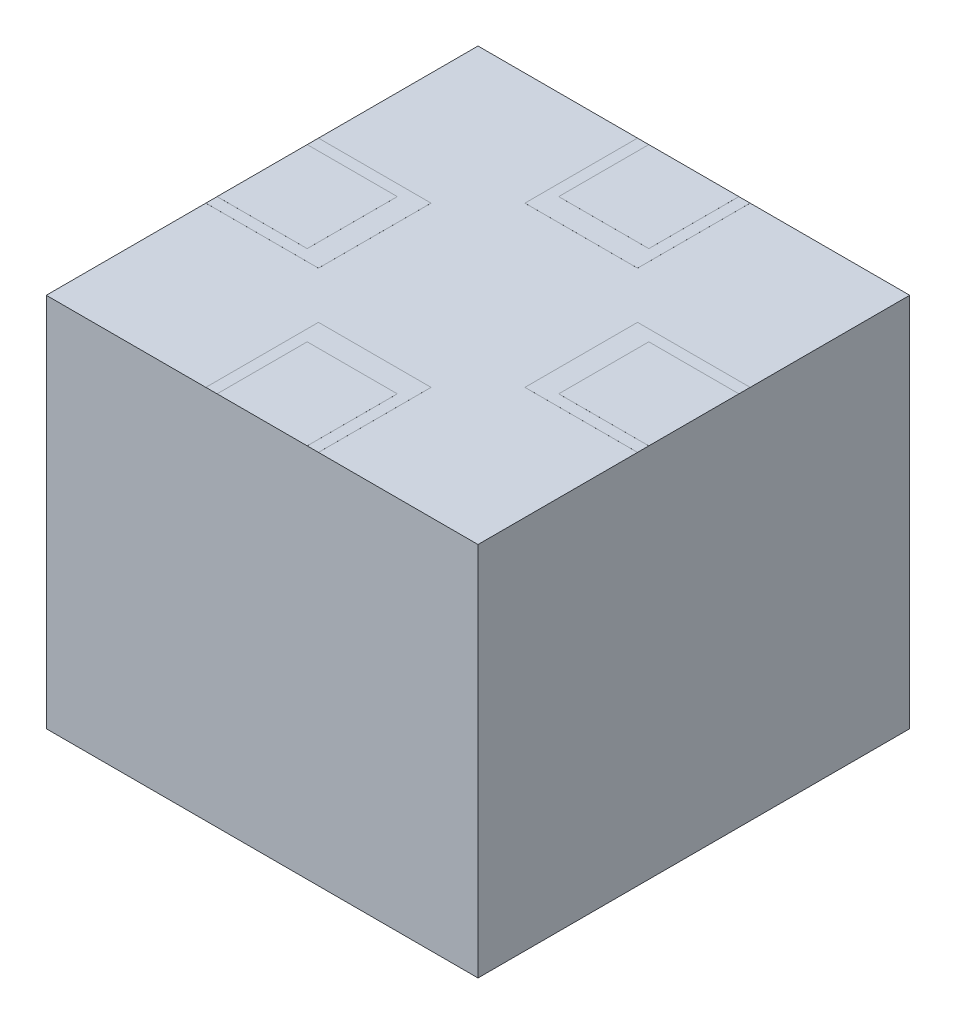
ISO-10303-21;
HEADER;
FILE_DESCRIPTION(('STEP AP214'),'2;1');
FILE_NAME('part.step','',(''),(''),'','','');
FILE_SCHEMA(('AUTOMOTIVE_DESIGN { 1 0 10303 214 1 1 1 1 }'));
ENDSEC;
DATA;
#1=APPLICATION_CONTEXT('core data for automotive mechanical design processes');
#2=APPLICATION_PROTOCOL_DEFINITION('international standard','automotive_design',2000,#1);
#3=PRODUCT_CONTEXT('',#1,'mechanical');
#4=PRODUCT('Part','Part','',(#3));
#5=PRODUCT_RELATED_PRODUCT_CATEGORY('part','',(#4));
#6=PRODUCT_DEFINITION_FORMATION('','',#4);
#7=PRODUCT_DEFINITION_CONTEXT('part definition',#1,'design');
#8=PRODUCT_DEFINITION('design','',#6,#7);
#9=PRODUCT_DEFINITION_SHAPE('','',#8);
#10=(LENGTH_UNIT() NAMED_UNIT(*) SI_UNIT(.MILLI.,.METRE.));
#11=(NAMED_UNIT(*) PLANE_ANGLE_UNIT() SI_UNIT($,.RADIAN.));
#12=(NAMED_UNIT(*) SI_UNIT($,.STERADIAN.) SOLID_ANGLE_UNIT());
#13=UNCERTAINTY_MEASURE_WITH_UNIT(LENGTH_MEASURE(1.E-05),#10,'distance_accuracy_value','');
#14=(GEOMETRIC_REPRESENTATION_CONTEXT(3) GLOBAL_UNCERTAINTY_ASSIGNED_CONTEXT((#13)) GLOBAL_UNIT_ASSIGNED_CONTEXT((#10,
#11,#12)) REPRESENTATION_CONTEXT('',''));
#15=CARTESIAN_POINT('',(0.,0.,0.));
#16=DIRECTION('',(0.,0.,1.));
#17=DIRECTION('',(1.,0.,0.));
#18=AXIS2_PLACEMENT_3D('',#15,#16,#17);
#19=CARTESIAN_POINT('',(0.,200.,0.));
#20=DIRECTION('',(0.,-1.,0.));
#21=DIRECTION('',(0.,0.,-1.));
#22=AXIS2_PLACEMENT_3D('',#19,#20,#21);
#23=PLANE('',#22);
#24=DIRECTION('',(-1.,0.,0.));
#25=VECTOR('',#24,1.);
#26=CARTESIAN_POINT('',(-115.,200.,-30.));
#27=LINE('',#26,#25);
#28=CARTESIAN_POINT('',(-55.,200.,-30.));
#29=VERTEX_POINT('',#28);
#30=CARTESIAN_POINT('',(-115.,200.,-30.));
#31=VERTEX_POINT('',#30);
#32=EDGE_CURVE('E383',#29,#31,#27,.T.);
#33=ORIENTED_EDGE('',*,*,#32,.F.);
#34=DIRECTION('',(0.,0.,-1.));
#35=VECTOR('',#34,1.);
#36=CARTESIAN_POINT('',(-55.,200.,29.9999999999999));
#37=LINE('',#36,#35);
#38=CARTESIAN_POINT('',(-55.,200.,29.9999999999999));
#39=VERTEX_POINT('',#38);
#40=EDGE_CURVE('E387',#39,#29,#37,.T.);
#41=ORIENTED_EDGE('',*,*,#40,.F.);
#42=DIRECTION('',(1.,0.,0.));
#43=VECTOR('',#42,1.);
#44=CARTESIAN_POINT('',(-115.,200.,30.));
#45=LINE('',#44,#43);
#46=CARTESIAN_POINT('',(-115.,200.,30.));
#47=VERTEX_POINT('',#46);
#48=EDGE_CURVE('E397',#47,#39,#45,.T.);
#49=ORIENTED_EDGE('',*,*,#48,.F.);
#50=DIRECTION('',(0.,0.,1.));
#51=VECTOR('',#50,1.);
#52=CARTESIAN_POINT('',(-115.,200.,115.));
#53=LINE('',#52,#51);
#54=CARTESIAN_POINT('',(-115.,200.,115.));
#55=VERTEX_POINT('',#54);
#56=EDGE_CURVE('E513',#47,#55,#53,.T.);
#57=ORIENTED_EDGE('',*,*,#56,.T.);
#58=DIRECTION('',(1.,0.,0.));
#59=VECTOR('',#58,1.);
#60=CARTESIAN_POINT('',(-115.,200.,115.));
#61=LINE('',#60,#59);
#62=CARTESIAN_POINT('',(-30.,200.,115.));
#63=VERTEX_POINT('',#62);
#64=EDGE_CURVE('E517',#55,#63,#61,.T.);
#65=ORIENTED_EDGE('',*,*,#64,.T.);
#66=DIRECTION('',(0.,0.,1.));
#67=VECTOR('',#66,1.);
#68=CARTESIAN_POINT('',(-30.,200.,115.));
#69=LINE('',#68,#67);
#70=CARTESIAN_POINT('',(-30.,200.,55.));
#71=VERTEX_POINT('',#70);
#72=EDGE_CURVE('E413',#71,#63,#69,.T.);
#73=ORIENTED_EDGE('',*,*,#72,.F.);
#74=DIRECTION('',(-1.,0.,0.));
#75=VECTOR('',#74,1.);
#76=CARTESIAN_POINT('',(29.9999999999999,200.,55.));
#77=LINE('',#76,#75);
#78=CARTESIAN_POINT('',(29.9999999999999,200.,55.));
#79=VERTEX_POINT('',#78);
#80=EDGE_CURVE('E418',#79,#71,#77,.T.);
#81=ORIENTED_EDGE('',*,*,#80,.F.);
#82=DIRECTION('',(0.,0.,-1.));
#83=VECTOR('',#82,1.);
#84=CARTESIAN_POINT('',(29.9999999999999,200.,115.));
#85=LINE('',#84,#83);
#86=CARTESIAN_POINT('',(29.9999999999999,200.,115.));
#87=VERTEX_POINT('',#86);
#88=EDGE_CURVE('E428',#87,#79,#85,.T.);
#89=ORIENTED_EDGE('',*,*,#88,.F.);
#90=CARTESIAN_POINT('',(115.,200.,115.));
#91=VERTEX_POINT('',#90);
#92=EDGE_CURVE('E516',#87,#91,#61,.T.);
#93=ORIENTED_EDGE('',*,*,#92,.T.);
#94=DIRECTION('',(0.,0.,-1.));
#95=VECTOR('',#94,1.);
#96=CARTESIAN_POINT('',(115.,200.,115.));
#97=LINE('',#96,#95);
#98=CARTESIAN_POINT('',(115.,200.,30.));
#99=VERTEX_POINT('',#98);
#100=EDGE_CURVE('E507',#91,#99,#97,.T.);
#101=ORIENTED_EDGE('',*,*,#100,.T.);
#102=DIRECTION('',(1.,0.,0.));
#103=VECTOR('',#102,1.);
#104=CARTESIAN_POINT('',(115.,200.,30.));
#105=LINE('',#104,#103);
#106=CARTESIAN_POINT('',(55.,200.,30.));
#107=VERTEX_POINT('',#106);
#108=EDGE_CURVE('E444',#107,#99,#105,.T.);
#109=ORIENTED_EDGE('',*,*,#108,.F.);
#110=DIRECTION('',(0.,0.,1.));
#111=VECTOR('',#110,1.);
#112=CARTESIAN_POINT('',(55.,200.,-29.9999999999999));
#113=LINE('',#112,#111);
#114=CARTESIAN_POINT('',(55.,200.,-29.9999999999999));
#115=VERTEX_POINT('',#114);
#116=EDGE_CURVE('E449',#115,#107,#113,.T.);
#117=ORIENTED_EDGE('',*,*,#116,.F.);
#118=DIRECTION('',(-1.,0.,0.));
#119=VECTOR('',#118,1.);
#120=CARTESIAN_POINT('',(115.,200.,-30.));
#121=LINE('',#120,#119);
#122=CARTESIAN_POINT('',(115.,200.,-30.));
#123=VERTEX_POINT('',#122);
#124=EDGE_CURVE('E459',#123,#115,#121,.T.);
#125=ORIENTED_EDGE('',*,*,#124,.F.);
#126=CARTESIAN_POINT('',(115.,200.,-115.));
#127=VERTEX_POINT('',#126);
#128=EDGE_CURVE('E510',#123,#127,#97,.T.);
#129=ORIENTED_EDGE('',*,*,#128,.T.);
#130=DIRECTION('',(-1.,0.,0.));
#131=VECTOR('',#130,1.);
#132=CARTESIAN_POINT('',(-115.,200.,-115.));
#133=LINE('',#132,#131);
#134=CARTESIAN_POINT('',(30.,200.,-115.));
#135=VERTEX_POINT('',#134);
#136=EDGE_CURVE('E511',#127,#135,#133,.T.);
#137=ORIENTED_EDGE('',*,*,#136,.T.);
#138=DIRECTION('',(0.,0.,-1.));
#139=VECTOR('',#138,1.);
#140=CARTESIAN_POINT('',(30.,200.,-115.));
#141=LINE('',#140,#139);
#142=CARTESIAN_POINT('',(30.,200.,-55.));
#143=VERTEX_POINT('',#142);
#144=EDGE_CURVE('E475',#143,#135,#141,.T.);
#145=ORIENTED_EDGE('',*,*,#144,.F.);
#146=DIRECTION('',(1.,0.,0.));
#147=VECTOR('',#146,1.);
#148=CARTESIAN_POINT('',(-30.,200.,-55.));
#149=LINE('',#148,#147);
#150=CARTESIAN_POINT('',(-30.,200.,-55.));
#151=VERTEX_POINT('',#150);
#152=EDGE_CURVE('E480',#151,#143,#149,.T.);
#153=ORIENTED_EDGE('',*,*,#152,.F.);
#154=DIRECTION('',(0.,0.,1.));
#155=VECTOR('',#154,1.);
#156=CARTESIAN_POINT('',(-30.,200.,-115.));
#157=LINE('',#156,#155);
#158=CARTESIAN_POINT('',(-30.,200.,-115.));
#159=VERTEX_POINT('',#158);
#160=EDGE_CURVE('E490',#159,#151,#157,.T.);
#161=ORIENTED_EDGE('',*,*,#160,.F.);
#162=CARTESIAN_POINT('',(-115.,200.,-115.));
#163=VERTEX_POINT('',#162);
#164=EDGE_CURVE('E509',#159,#163,#133,.T.);
#165=ORIENTED_EDGE('',*,*,#164,.T.);
#166=EDGE_CURVE('E514',#163,#31,#53,.T.);
#167=ORIENTED_EDGE('',*,*,#166,.T.);
#168=EDGE_LOOP('',(#33,#41,#49,#57,#65,#73,#81,#89,#93,#101,#109,#117,#125,#129,#137,#145,#153,
#161,#165,#167));
#169=FACE_BOUND('',#168,.T.);
#170=ADVANCED_FACE('F33',(#169),#23,.F.);
#171=CARTESIAN_POINT('',(115.,200.,115.));
#172=DIRECTION('',(-1.,0.,0.));
#173=DIRECTION('',(0.,0.,1.));
#174=AXIS2_PLACEMENT_3D('',#171,#172,#173);
#175=PLANE('',#174);
#176=DIRECTION('',(0.,0.,-1.));
#177=VECTOR('',#176,1.);
#178=CARTESIAN_POINT('',(115.,0.,115.));
#179=LINE('',#178,#177);
#180=CARTESIAN_POINT('',(115.,0.,115.));
#181=VERTEX_POINT('',#180);
#182=CARTESIAN_POINT('',(115.,0.,-115.));
#183=VERTEX_POINT('',#182);
#184=EDGE_CURVE('E506',#181,#183,#179,.T.);
#185=ORIENTED_EDGE('',*,*,#184,.T.);
#186=DIRECTION('',(0.,-1.,0.));
#187=VECTOR('',#186,1.);
#188=CARTESIAN_POINT('',(115.,200.,-115.));
#189=LINE('',#188,#187);
#190=EDGE_CURVE('E11',#127,#183,#189,.T.);
#191=ORIENTED_EDGE('',*,*,#190,.F.);
#192=ORIENTED_EDGE('',*,*,#128,.F.);
#193=DIRECTION('',(0.,-1.,0.));
#194=VECTOR('',#193,1.);
#195=CARTESIAN_POINT('',(115.,200.01,-30.));
#196=LINE('',#195,#194);
#197=CARTESIAN_POINT('',(115.,200.01,-30.));
#198=VERTEX_POINT('',#197);
#199=EDGE_CURVE('E469',#198,#123,#196,.T.);
#200=ORIENTED_EDGE('',*,*,#199,.F.);
#201=DIRECTION('',(0.,0.,-1.));
#202=VECTOR('',#201,1.);
#203=CARTESIAN_POINT('',(115.,200.01,-30.));
#204=LINE('',#203,#202);
#205=CARTESIAN_POINT('',(115.,200.01,-24.0000000000104));
#206=VERTEX_POINT('',#205);
#207=EDGE_CURVE('E448',#206,#198,#204,.T.);
#208=ORIENTED_EDGE('',*,*,#207,.F.);
#209=DIRECTION('',(0.,-1.,0.));
#210=VECTOR('',#209,1.);
#211=CARTESIAN_POINT('',(115.000000000005,200.02,-24.0000000000104));
#212=LINE('',#211,#210);
#213=CARTESIAN_POINT('',(115.000000000005,200.02,-24.0000000000104));
#214=VERTEX_POINT('',#213);
#215=EDGE_CURVE('E350',#214,#206,#212,.T.);
#216=ORIENTED_EDGE('',*,*,#215,.F.);
#217=DIRECTION('',(0.,0.,-1.));
#218=VECTOR('',#217,1.);
#219=CARTESIAN_POINT('',(115.000000000005,200.02,-24.0000000000104));
#220=LINE('',#219,#218);
#221=CARTESIAN_POINT('',(115.000000000005,200.02,23.9999999999896));
#222=VERTEX_POINT('',#221);
#223=EDGE_CURVE('E324',#222,#214,#220,.T.);
#224=ORIENTED_EDGE('',*,*,#223,.F.);
#225=DIRECTION('',(0.,-1.,0.));
#226=VECTOR('',#225,1.);
#227=CARTESIAN_POINT('',(115.000000000005,200.02,23.9999999999896));
#228=LINE('',#227,#226);
#229=CARTESIAN_POINT('',(115.,200.01,23.9999999999896));
#230=VERTEX_POINT('',#229);
#231=EDGE_CURVE('E334',#222,#230,#228,.T.);
#232=ORIENTED_EDGE('',*,*,#231,.T.);
#233=CARTESIAN_POINT('',(115.,200.01,30.));
#234=VERTEX_POINT('',#233);
#235=EDGE_CURVE('E450',#234,#230,#204,.T.);
#236=ORIENTED_EDGE('',*,*,#235,.F.);
#237=DIRECTION('',(0.,-1.,0.));
#238=VECTOR('',#237,1.);
#239=CARTESIAN_POINT('',(115.,200.01,30.));
#240=LINE('',#239,#238);
#241=EDGE_CURVE('E472',#234,#99,#240,.T.);
#242=ORIENTED_EDGE('',*,*,#241,.T.);
#243=ORIENTED_EDGE('',*,*,#100,.F.);
#244=DIRECTION('',(0.,-1.,0.));
#245=VECTOR('',#244,1.);
#246=CARTESIAN_POINT('',(115.,200.,115.));
#247=LINE('',#246,#245);
#248=EDGE_CURVE('E519',#91,#181,#247,.T.);
#249=ORIENTED_EDGE('',*,*,#248,.T.);
#250=EDGE_LOOP('',(#185,#191,#192,#200,#208,#216,#224,#232,#236,#242,#243,#249));
#251=FACE_BOUND('',#250,.T.);
#252=ADVANCED_FACE('F35',(#251),#175,.F.);
#253=CARTESIAN_POINT('',(-115.,200.,-115.));
#254=DIRECTION('',(0.,0.,1.));
#255=DIRECTION('',(1.,0.,0.));
#256=AXIS2_PLACEMENT_3D('',#253,#254,#255);
#257=PLANE('',#256);
#258=DIRECTION('',(-1.,0.,0.));
#259=VECTOR('',#258,1.);
#260=CARTESIAN_POINT('',(-115.,0.,-115.));
#261=LINE('',#260,#259);
#262=CARTESIAN_POINT('',(-115.,0.,-115.));
#263=VERTEX_POINT('',#262);
#264=EDGE_CURVE('E522',#183,#263,#261,.T.);
#265=ORIENTED_EDGE('',*,*,#264,.T.);
#266=DIRECTION('',(0.,-1.,0.));
#267=VECTOR('',#266,1.);
#268=CARTESIAN_POINT('',(-115.,200.,-115.));
#269=LINE('',#268,#267);
#270=EDGE_CURVE('E41',#163,#263,#269,.T.);
#271=ORIENTED_EDGE('',*,*,#270,.F.);
#272=ORIENTED_EDGE('',*,*,#164,.F.);
#273=DIRECTION('',(0.,-1.,0.));
#274=VECTOR('',#273,1.);
#275=CARTESIAN_POINT('',(-30.,200.01,-115.));
#276=LINE('',#275,#274);
#277=CARTESIAN_POINT('',(-30.,200.01,-115.));
#278=VERTEX_POINT('',#277);
#279=EDGE_CURVE('E500',#278,#159,#276,.T.);
#280=ORIENTED_EDGE('',*,*,#279,.F.);
#281=DIRECTION('',(-1.,0.,0.));
#282=VECTOR('',#281,1.);
#283=CARTESIAN_POINT('',(-30.,200.01,-115.));
#284=LINE('',#283,#282);
#285=CARTESIAN_POINT('',(-24.,200.01,-115.));
#286=VERTEX_POINT('',#285);
#287=EDGE_CURVE('E479',#286,#278,#284,.T.);
#288=ORIENTED_EDGE('',*,*,#287,.F.);
#289=DIRECTION('',(0.,-1.,0.));
#290=VECTOR('',#289,1.);
#291=CARTESIAN_POINT('',(-24.,200.02,-115.));
#292=LINE('',#291,#290);
#293=CARTESIAN_POINT('',(-24.,200.02,-115.));
#294=VERTEX_POINT('',#293);
#295=EDGE_CURVE('E380',#294,#286,#292,.T.);
#296=ORIENTED_EDGE('',*,*,#295,.F.);
#297=DIRECTION('',(-1.,0.,0.));
#298=VECTOR('',#297,1.);
#299=CARTESIAN_POINT('',(-24.,200.02,-115.));
#300=LINE('',#299,#298);
#301=CARTESIAN_POINT('',(24.,200.02,-115.));
#302=VERTEX_POINT('',#301);
#303=EDGE_CURVE('E354',#302,#294,#300,.T.);
#304=ORIENTED_EDGE('',*,*,#303,.F.);
#305=DIRECTION('',(0.,-1.,0.));
#306=VECTOR('',#305,1.);
#307=CARTESIAN_POINT('',(24.,200.02,-115.));
#308=LINE('',#307,#306);
#309=CARTESIAN_POINT('',(24.,200.01,-115.));
#310=VERTEX_POINT('',#309);
#311=EDGE_CURVE('E364',#302,#310,#308,.T.);
#312=ORIENTED_EDGE('',*,*,#311,.T.);
#313=CARTESIAN_POINT('',(30.,200.01,-115.));
#314=VERTEX_POINT('',#313);
#315=EDGE_CURVE('E481',#314,#310,#284,.T.);
#316=ORIENTED_EDGE('',*,*,#315,.F.);
#317=DIRECTION('',(0.,-1.,0.));
#318=VECTOR('',#317,1.);
#319=CARTESIAN_POINT('',(30.,200.01,-115.));
#320=LINE('',#319,#318);
#321=EDGE_CURVE('E503',#314,#135,#320,.T.);
#322=ORIENTED_EDGE('',*,*,#321,.T.);
#323=ORIENTED_EDGE('',*,*,#136,.F.);
#324=ORIENTED_EDGE('',*,*,#190,.T.);
#325=EDGE_LOOP('',(#265,#271,#272,#280,#288,#296,#304,#312,#316,#322,#323,#324));
#326=FACE_BOUND('',#325,.T.);
#327=ADVANCED_FACE('F625',(#326),#257,.F.);
#328=CARTESIAN_POINT('',(-115.,200.,115.));
#329=DIRECTION('',(1.,0.,0.));
#330=DIRECTION('',(0.,0.,-1.));
#331=AXIS2_PLACEMENT_3D('',#328,#329,#330);
#332=PLANE('',#331);
#333=DIRECTION('',(0.,0.,1.));
#334=VECTOR('',#333,1.);
#335=CARTESIAN_POINT('',(-115.,0.,115.));
#336=LINE('',#335,#334);
#337=CARTESIAN_POINT('',(-115.,0.,115.));
#338=VERTEX_POINT('',#337);
#339=EDGE_CURVE('E524',#263,#338,#336,.T.);
#340=ORIENTED_EDGE('',*,*,#339,.T.);
#341=DIRECTION('',(0.,-1.,0.));
#342=VECTOR('',#341,1.);
#343=CARTESIAN_POINT('',(-115.,200.,115.));
#344=LINE('',#343,#342);
#345=EDGE_CURVE('E530',#55,#338,#344,.T.);
#346=ORIENTED_EDGE('',*,*,#345,.F.);
#347=ORIENTED_EDGE('',*,*,#56,.F.);
#348=DIRECTION('',(0.,-1.,0.));
#349=VECTOR('',#348,1.);
#350=CARTESIAN_POINT('',(-115.,200.01,30.));
#351=LINE('',#350,#349);
#352=CARTESIAN_POINT('',(-115.,200.01,30.));
#353=VERTEX_POINT('',#352);
#354=EDGE_CURVE('E407',#353,#47,#351,.T.);
#355=ORIENTED_EDGE('',*,*,#354,.F.);
#356=DIRECTION('',(0.,0.,1.));
#357=VECTOR('',#356,1.);
#358=CARTESIAN_POINT('',(-115.,200.01,30.));
#359=LINE('',#358,#357);
#360=CARTESIAN_POINT('',(-115.,200.01,24.0000000000049));
#361=VERTEX_POINT('',#360);
#362=EDGE_CURVE('E287',#361,#353,#359,.T.);
#363=ORIENTED_EDGE('',*,*,#362,.F.);
#364=DIRECTION('',(0.,-1.,0.));
#365=VECTOR('',#364,1.);
#366=CARTESIAN_POINT('',(-114.99999999999,200.02,24.0000000000049));
#367=LINE('',#366,#365);
#368=CARTESIAN_POINT('',(-114.99999999999,200.02,24.0000000000049));
#369=VERTEX_POINT('',#368);
#370=EDGE_CURVE('E269',#369,#361,#367,.T.);
#371=ORIENTED_EDGE('',*,*,#370,.F.);
#372=DIRECTION('',(0.,0.,1.));
#373=VECTOR('',#372,1.);
#374=CARTESIAN_POINT('',(-114.99999999999,200.02,24.0000000000049));
#375=LINE('',#374,#373);
#376=CARTESIAN_POINT('',(-114.99999999999,200.02,-23.9999999999951));
#377=VERTEX_POINT('',#376);
#378=EDGE_CURVE('E275',#377,#369,#375,.T.);
#379=ORIENTED_EDGE('',*,*,#378,.F.);
#380=DIRECTION('',(0.,-1.,0.));
#381=VECTOR('',#380,1.);
#382=CARTESIAN_POINT('',(-114.99999999999,200.02,-23.9999999999951));
#383=LINE('',#382,#381);
#384=CARTESIAN_POINT('',(-115.,200.01,-23.9999999999951));
#385=VERTEX_POINT('',#384);
#386=EDGE_CURVE('E596',#377,#385,#383,.T.);
#387=ORIENTED_EDGE('',*,*,#386,.T.);
#388=CARTESIAN_POINT('',(-115.,200.01,-30.));
#389=VERTEX_POINT('',#388);
#390=EDGE_CURVE('E388',#389,#385,#359,.T.);
#391=ORIENTED_EDGE('',*,*,#390,.F.);
#392=DIRECTION('',(0.,-1.,0.));
#393=VECTOR('',#392,1.);
#394=CARTESIAN_POINT('',(-115.,200.01,-30.));
#395=LINE('',#394,#393);
#396=EDGE_CURVE('E410',#389,#31,#395,.T.);
#397=ORIENTED_EDGE('',*,*,#396,.T.);
#398=ORIENTED_EDGE('',*,*,#166,.F.);
#399=ORIENTED_EDGE('',*,*,#270,.T.);
#400=EDGE_LOOP('',(#340,#346,#347,#355,#363,#371,#379,#387,#391,#397,#398,#399));
#401=FACE_BOUND('',#400,.T.);
#402=ADVANCED_FACE('F285',(#401),#332,.F.);
#403=CARTESIAN_POINT('',(-115.,200.,115.));
#404=DIRECTION('',(0.,0.,-1.));
#405=DIRECTION('',(-1.,0.,0.));
#406=AXIS2_PLACEMENT_3D('',#403,#404,#405);
#407=PLANE('',#406);
#408=DIRECTION('',(1.,0.,0.));
#409=VECTOR('',#408,1.);
#410=CARTESIAN_POINT('',(-115.,0.,115.));
#411=LINE('',#410,#409);
#412=EDGE_CURVE('E526',#338,#181,#411,.T.);
#413=ORIENTED_EDGE('',*,*,#412,.T.);
#414=ORIENTED_EDGE('',*,*,#248,.F.);
#415=ORIENTED_EDGE('',*,*,#92,.F.);
#416=DIRECTION('',(0.,-1.,0.));
#417=VECTOR('',#416,1.);
#418=CARTESIAN_POINT('',(29.9999999999999,200.01,115.));
#419=LINE('',#418,#417);
#420=CARTESIAN_POINT('',(29.9999999999999,200.01,115.));
#421=VERTEX_POINT('',#420);
#422=EDGE_CURVE('E438',#421,#87,#419,.T.);
#423=ORIENTED_EDGE('',*,*,#422,.F.);
#424=DIRECTION('',(1.,0.,0.));
#425=VECTOR('',#424,1.);
#426=CARTESIAN_POINT('',(29.9999999999999,200.01,115.));
#427=LINE('',#426,#425);
#428=CARTESIAN_POINT('',(24.0000000000152,200.01,115.));
#429=VERTEX_POINT('',#428);
#430=EDGE_CURVE('E417',#429,#421,#427,.T.);
#431=ORIENTED_EDGE('',*,*,#430,.F.);
#432=DIRECTION('',(0.,-1.,0.));
#433=VECTOR('',#432,1.);
#434=CARTESIAN_POINT('',(24.0000000000153,200.02,114.999999999995));
#435=LINE('',#434,#433);
#436=CARTESIAN_POINT('',(24.0000000000153,200.02,114.999999999995));
#437=VERTEX_POINT('',#436);
#438=EDGE_CURVE('E320',#437,#429,#435,.T.);
#439=ORIENTED_EDGE('',*,*,#438,.F.);
#440=DIRECTION('',(1.,0.,0.));
#441=VECTOR('',#440,1.);
#442=CARTESIAN_POINT('',(24.0000000000153,200.02,114.999999999995));
#443=LINE('',#442,#441);
#444=CARTESIAN_POINT('',(-23.9999999999847,200.02,114.999999999995));
#445=VERTEX_POINT('',#444);
#446=EDGE_CURVE('E297',#445,#437,#443,.T.);
#447=ORIENTED_EDGE('',*,*,#446,.F.);
#448=DIRECTION('',(0.,-1.,0.));
#449=VECTOR('',#448,1.);
#450=CARTESIAN_POINT('',(-23.9999999999847,200.02,114.999999999995));
#451=LINE('',#450,#449);
#452=CARTESIAN_POINT('',(-23.9999999999847,200.01,115.));
#453=VERTEX_POINT('',#452);
#454=EDGE_CURVE('E306',#445,#453,#451,.T.);
#455=ORIENTED_EDGE('',*,*,#454,.T.);
#456=CARTESIAN_POINT('',(-30.,200.01,115.));
#457=VERTEX_POINT('',#456);
#458=EDGE_CURVE('E419',#457,#453,#427,.T.);
#459=ORIENTED_EDGE('',*,*,#458,.F.);
#460=DIRECTION('',(0.,-1.,0.));
#461=VECTOR('',#460,1.);
#462=CARTESIAN_POINT('',(-30.,200.01,115.));
#463=LINE('',#462,#461);
#464=EDGE_CURVE('E441',#457,#63,#463,.T.);
#465=ORIENTED_EDGE('',*,*,#464,.T.);
#466=ORIENTED_EDGE('',*,*,#64,.F.);
#467=ORIENTED_EDGE('',*,*,#345,.T.);
#468=EDGE_LOOP('',(#413,#414,#415,#423,#431,#439,#447,#455,#459,#465,#466,#467));
#469=FACE_BOUND('',#468,.T.);
#470=ADVANCED_FACE('F545',(#469),#407,.F.);
#471=CARTESIAN_POINT('',(0.,0.,0.));
#472=DIRECTION('',(0.,-1.,0.));
#473=DIRECTION('',(0.,0.,-1.));
#474=AXIS2_PLACEMENT_3D('',#471,#472,#473);
#475=PLANE('',#474);
#476=ORIENTED_EDGE('',*,*,#184,.F.);
#477=ORIENTED_EDGE('',*,*,#412,.F.);
#478=ORIENTED_EDGE('',*,*,#339,.F.);
#479=ORIENTED_EDGE('',*,*,#264,.F.);
#480=EDGE_LOOP('',(#476,#477,#478,#479));
#481=FACE_BOUND('',#480,.T.);
#482=ADVANCED_FACE('F542',(#481),#475,.T.);
#483=CARTESIAN_POINT('',(30.,200.01,-115.));
#484=DIRECTION('',(-1.,0.,0.));
#485=DIRECTION('',(0.,0.,1.));
#486=AXIS2_PLACEMENT_3D('',#483,#484,#485);
#487=PLANE('',#486);
#488=ORIENTED_EDGE('',*,*,#144,.T.);
#489=ORIENTED_EDGE('',*,*,#321,.F.);
#490=DIRECTION('',(0.,0.,-1.));
#491=VECTOR('',#490,1.);
#492=CARTESIAN_POINT('',(30.,200.01,-115.));
#493=LINE('',#492,#491);
#494=CARTESIAN_POINT('',(30.,200.01,-55.));
#495=VERTEX_POINT('',#494);
#496=EDGE_CURVE('E476',#495,#314,#493,.T.);
#497=ORIENTED_EDGE('',*,*,#496,.F.);
#498=DIRECTION('',(0.,-1.,0.));
#499=VECTOR('',#498,1.);
#500=CARTESIAN_POINT('',(30.,200.01,-55.));
#501=LINE('',#500,#499);
#502=EDGE_CURVE('E487',#495,#143,#501,.T.);
#503=ORIENTED_EDGE('',*,*,#502,.T.);
#504=EDGE_LOOP('',(#488,#489,#497,#503));
#505=FACE_BOUND('',#504,.T.);
#506=ADVANCED_FACE('F628',(#505),#487,.F.);
#507=CARTESIAN_POINT('',(-30.,200.01,-115.));
#508=DIRECTION('',(1.,0.,0.));
#509=DIRECTION('',(0.,0.,-1.));
#510=AXIS2_PLACEMENT_3D('',#507,#508,#509);
#511=PLANE('',#510);
#512=ORIENTED_EDGE('',*,*,#160,.T.);
#513=DIRECTION('',(0.,-1.,0.));
#514=VECTOR('',#513,1.);
#515=CARTESIAN_POINT('',(-30.,200.01,-55.));
#516=LINE('',#515,#514);
#517=CARTESIAN_POINT('',(-30.,200.01,-55.));
#518=VERTEX_POINT('',#517);
#519=EDGE_CURVE('E497',#518,#151,#516,.T.);
#520=ORIENTED_EDGE('',*,*,#519,.F.);
#521=DIRECTION('',(0.,0.,1.));
#522=VECTOR('',#521,1.);
#523=CARTESIAN_POINT('',(-30.,200.01,-115.));
#524=LINE('',#523,#522);
#525=EDGE_CURVE('E483',#278,#518,#524,.T.);
#526=ORIENTED_EDGE('',*,*,#525,.F.);
#527=ORIENTED_EDGE('',*,*,#279,.T.);
#528=EDGE_LOOP('',(#512,#520,#526,#527));
#529=FACE_BOUND('',#528,.T.);
#530=ADVANCED_FACE('F727',(#529),#511,.F.);
#531=CARTESIAN_POINT('',(-30.,200.01,-55.));
#532=DIRECTION('',(0.,0.,-1.));
#533=DIRECTION('',(-1.,0.,0.));
#534=AXIS2_PLACEMENT_3D('',#531,#532,#533);
#535=PLANE('',#534);
#536=ORIENTED_EDGE('',*,*,#152,.T.);
#537=ORIENTED_EDGE('',*,*,#502,.F.);
#538=DIRECTION('',(1.,0.,0.));
#539=VECTOR('',#538,1.);
#540=CARTESIAN_POINT('',(-30.,200.01,-55.));
#541=LINE('',#540,#539);
#542=EDGE_CURVE('E485',#518,#495,#541,.T.);
#543=ORIENTED_EDGE('',*,*,#542,.F.);
#544=ORIENTED_EDGE('',*,*,#519,.T.);
#545=EDGE_LOOP('',(#536,#537,#543,#544));
#546=FACE_BOUND('',#545,.T.);
#547=ADVANCED_FACE('F724',(#546),#535,.F.);
#548=CARTESIAN_POINT('',(0.,200.01,0.));
#549=DIRECTION('',(0.,1.,0.));
#550=DIRECTION('',(0.,0.,1.));
#551=AXIS2_PLACEMENT_3D('',#548,#549,#550);
#552=PLANE('',#551);
#553=DIRECTION('',(0.,0.,-1.));
#554=VECTOR('',#553,1.);
#555=CARTESIAN_POINT('',(24.,200.01,-67.));
#556=LINE('',#555,#554);
#557=CARTESIAN_POINT('',(24.,200.01,-67.));
#558=VERTEX_POINT('',#557);
#559=EDGE_CURVE('E358',#558,#310,#556,.T.);
#560=ORIENTED_EDGE('',*,*,#559,.F.);
#561=DIRECTION('',(1.,0.,0.));
#562=VECTOR('',#561,1.);
#563=CARTESIAN_POINT('',(-24.,200.01,-67.));
#564=LINE('',#563,#562);
#565=CARTESIAN_POINT('',(-24.,200.01,-67.));
#566=VERTEX_POINT('',#565);
#567=EDGE_CURVE('E367',#566,#558,#564,.T.);
#568=ORIENTED_EDGE('',*,*,#567,.F.);
#569=DIRECTION('',(0.,0.,1.));
#570=VECTOR('',#569,1.);
#571=CARTESIAN_POINT('',(-24.,200.01,-115.));
#572=LINE('',#571,#570);
#573=EDGE_CURVE('E353',#286,#566,#572,.T.);
#574=ORIENTED_EDGE('',*,*,#573,.F.);
#575=ORIENTED_EDGE('',*,*,#287,.T.);
#576=ORIENTED_EDGE('',*,*,#525,.T.);
#577=ORIENTED_EDGE('',*,*,#542,.T.);
#578=ORIENTED_EDGE('',*,*,#496,.T.);
#579=ORIENTED_EDGE('',*,*,#315,.T.);
#580=EDGE_LOOP('',(#560,#568,#574,#575,#576,#577,#578,#579));
#581=FACE_BOUND('',#580,.T.);
#582=ADVANCED_FACE('F720',(#581),#552,.T.);
#583=CARTESIAN_POINT('',(115.,200.01,30.));
#584=DIRECTION('',(0.,0.,-1.));
#585=DIRECTION('',(-1.,0.,0.));
#586=AXIS2_PLACEMENT_3D('',#583,#584,#585);
#587=PLANE('',#586);
#588=ORIENTED_EDGE('',*,*,#108,.T.);
#589=ORIENTED_EDGE('',*,*,#241,.F.);
#590=DIRECTION('',(1.,0.,0.));
#591=VECTOR('',#590,1.);
#592=CARTESIAN_POINT('',(115.,200.01,30.));
#593=LINE('',#592,#591);
#594=CARTESIAN_POINT('',(55.,200.01,30.));
#595=VERTEX_POINT('',#594);
#596=EDGE_CURVE('E445',#595,#234,#593,.T.);
#597=ORIENTED_EDGE('',*,*,#596,.F.);
#598=DIRECTION('',(0.,-1.,0.));
#599=VECTOR('',#598,1.);
#600=CARTESIAN_POINT('',(55.,200.01,30.));
#601=LINE('',#600,#599);
#602=EDGE_CURVE('E456',#595,#107,#601,.T.);
#603=ORIENTED_EDGE('',*,*,#602,.T.);
#604=EDGE_LOOP('',(#588,#589,#597,#603));
#605=FACE_BOUND('',#604,.T.);
#606=ADVANCED_FACE('F717',(#605),#587,.F.);
#607=CARTESIAN_POINT('',(115.,200.01,-30.));
#608=DIRECTION('',(0.,0.,1.));
#609=DIRECTION('',(1.,0.,0.));
#610=AXIS2_PLACEMENT_3D('',#607,#608,#609);
#611=PLANE('',#610);
#612=ORIENTED_EDGE('',*,*,#124,.T.);
#613=DIRECTION('',(0.,-1.,0.));
#614=VECTOR('',#613,1.);
#615=CARTESIAN_POINT('',(55.,200.01,-29.9999999999999));
#616=LINE('',#615,#614);
#617=CARTESIAN_POINT('',(55.,200.01,-29.9999999999999));
#618=VERTEX_POINT('',#617);
#619=EDGE_CURVE('E466',#618,#115,#616,.T.);
#620=ORIENTED_EDGE('',*,*,#619,.F.);
#621=DIRECTION('',(-1.,0.,0.));
#622=VECTOR('',#621,1.);
#623=CARTESIAN_POINT('',(115.,200.01,-30.));
#624=LINE('',#623,#622);
#625=EDGE_CURVE('E452',#198,#618,#624,.T.);
#626=ORIENTED_EDGE('',*,*,#625,.F.);
#627=ORIENTED_EDGE('',*,*,#199,.T.);
#628=EDGE_LOOP('',(#612,#620,#626,#627));
#629=FACE_BOUND('',#628,.T.);
#630=ADVANCED_FACE('F645',(#629),#611,.F.);
#631=CARTESIAN_POINT('',(55.,200.01,-29.9999999999999));
#632=DIRECTION('',(1.,0.,0.));
#633=DIRECTION('',(0.,0.,-1.));
#634=AXIS2_PLACEMENT_3D('',#631,#632,#633);
#635=PLANE('',#634);
#636=ORIENTED_EDGE('',*,*,#116,.T.);
#637=ORIENTED_EDGE('',*,*,#602,.F.);
#638=DIRECTION('',(0.,0.,1.));
#639=VECTOR('',#638,1.);
#640=CARTESIAN_POINT('',(55.,200.01,-29.9999999999999));
#641=LINE('',#640,#639);
#642=EDGE_CURVE('E454',#618,#595,#641,.T.);
#643=ORIENTED_EDGE('',*,*,#642,.F.);
#644=ORIENTED_EDGE('',*,*,#619,.T.);
#645=EDGE_LOOP('',(#636,#637,#643,#644));
#646=FACE_BOUND('',#645,.T.);
#647=ADVANCED_FACE('F711',(#646),#635,.F.);
#648=CARTESIAN_POINT('',(0.,200.01,0.));
#649=DIRECTION('',(0.,1.,0.));
#650=DIRECTION('',(0.,0.,1.));
#651=AXIS2_PLACEMENT_3D('',#648,#649,#650);
#652=PLANE('',#651);
#653=DIRECTION('',(1.,0.,0.));
#654=VECTOR('',#653,1.);
#655=CARTESIAN_POINT('',(67.0000000000049,200.01,23.9999999999896));
#656=LINE('',#655,#654);
#657=CARTESIAN_POINT('',(67.0000000000049,200.01,23.9999999999896));
#658=VERTEX_POINT('',#657);
#659=EDGE_CURVE('E328',#658,#230,#656,.T.);
#660=ORIENTED_EDGE('',*,*,#659,.F.);
#661=DIRECTION('',(0.,0.,1.));
#662=VECTOR('',#661,1.);
#663=CARTESIAN_POINT('',(67.0000000000049,200.01,-24.0000000000103));
#664=LINE('',#663,#662);
#665=CARTESIAN_POINT('',(67.0000000000049,200.01,-24.0000000000103));
#666=VERTEX_POINT('',#665);
#667=EDGE_CURVE('E337',#666,#658,#664,.T.);
#668=ORIENTED_EDGE('',*,*,#667,.F.);
#669=DIRECTION('',(-1.,0.,0.));
#670=VECTOR('',#669,1.);
#671=CARTESIAN_POINT('',(115.000000000005,200.01,-24.0000000000104));
#672=LINE('',#671,#670);
#673=EDGE_CURVE('E323',#206,#666,#672,.T.);
#674=ORIENTED_EDGE('',*,*,#673,.F.);
#675=ORIENTED_EDGE('',*,*,#207,.T.);
#676=ORIENTED_EDGE('',*,*,#625,.T.);
#677=ORIENTED_EDGE('',*,*,#642,.T.);
#678=ORIENTED_EDGE('',*,*,#596,.T.);
#679=ORIENTED_EDGE('',*,*,#235,.T.);
#680=EDGE_LOOP('',(#660,#668,#674,#675,#676,#677,#678,#679));
#681=FACE_BOUND('',#680,.T.);
#682=ADVANCED_FACE('F648',(#681),#652,.T.);
#683=CARTESIAN_POINT('',(-30.,200.01,115.));
#684=DIRECTION('',(1.,0.,0.));
#685=DIRECTION('',(0.,0.,-1.));
#686=AXIS2_PLACEMENT_3D('',#683,#684,#685);
#687=PLANE('',#686);
#688=ORIENTED_EDGE('',*,*,#72,.T.);
#689=ORIENTED_EDGE('',*,*,#464,.F.);
#690=DIRECTION('',(0.,0.,1.));
#691=VECTOR('',#690,1.);
#692=CARTESIAN_POINT('',(-30.,200.01,115.));
#693=LINE('',#692,#691);
#694=CARTESIAN_POINT('',(-30.,200.01,55.));
#695=VERTEX_POINT('',#694);
#696=EDGE_CURVE('E414',#695,#457,#693,.T.);
#697=ORIENTED_EDGE('',*,*,#696,.F.);
#698=DIRECTION('',(0.,-1.,0.));
#699=VECTOR('',#698,1.);
#700=CARTESIAN_POINT('',(-30.,200.01,55.));
#701=LINE('',#700,#699);
#702=EDGE_CURVE('E425',#695,#71,#701,.T.);
#703=ORIENTED_EDGE('',*,*,#702,.T.);
#704=EDGE_LOOP('',(#688,#689,#697,#703));
#705=FACE_BOUND('',#704,.T.);
#706=ADVANCED_FACE('F581',(#705),#687,.F.);
#707=CARTESIAN_POINT('',(29.9999999999999,200.01,115.));
#708=DIRECTION('',(-1.,0.,0.));
#709=DIRECTION('',(0.,0.,1.));
#710=AXIS2_PLACEMENT_3D('',#707,#708,#709);
#711=PLANE('',#710);
#712=ORIENTED_EDGE('',*,*,#88,.T.);
#713=DIRECTION('',(0.,-1.,0.));
#714=VECTOR('',#713,1.);
#715=CARTESIAN_POINT('',(29.9999999999999,200.01,55.));
#716=LINE('',#715,#714);
#717=CARTESIAN_POINT('',(29.9999999999999,200.01,55.));
#718=VERTEX_POINT('',#717);
#719=EDGE_CURVE('E435',#718,#79,#716,.T.);
#720=ORIENTED_EDGE('',*,*,#719,.F.);
#721=DIRECTION('',(0.,0.,-1.));
#722=VECTOR('',#721,1.);
#723=CARTESIAN_POINT('',(29.9999999999999,200.01,115.));
#724=LINE('',#723,#722);
#725=EDGE_CURVE('E421',#421,#718,#724,.T.);
#726=ORIENTED_EDGE('',*,*,#725,.F.);
#727=ORIENTED_EDGE('',*,*,#422,.T.);
#728=EDGE_LOOP('',(#712,#720,#726,#727));
#729=FACE_BOUND('',#728,.T.);
#730=ADVANCED_FACE('F559',(#729),#711,.F.);
#731=CARTESIAN_POINT('',(29.9999999999999,200.01,55.));
#732=DIRECTION('',(0.,0.,1.));
#733=DIRECTION('',(1.,0.,0.));
#734=AXIS2_PLACEMENT_3D('',#731,#732,#733);
#735=PLANE('',#734);
#736=ORIENTED_EDGE('',*,*,#80,.T.);
#737=ORIENTED_EDGE('',*,*,#702,.F.);
#738=DIRECTION('',(-1.,0.,0.));
#739=VECTOR('',#738,1.);
#740=CARTESIAN_POINT('',(29.9999999999999,200.01,55.));
#741=LINE('',#740,#739);
#742=EDGE_CURVE('E423',#718,#695,#741,.T.);
#743=ORIENTED_EDGE('',*,*,#742,.F.);
#744=ORIENTED_EDGE('',*,*,#719,.T.);
#745=EDGE_LOOP('',(#736,#737,#743,#744));
#746=FACE_BOUND('',#745,.T.);
#747=ADVANCED_FACE('F701',(#746),#735,.F.);
#748=CARTESIAN_POINT('',(0.,200.01,0.));
#749=DIRECTION('',(0.,1.,0.));
#750=DIRECTION('',(0.,0.,1.));
#751=AXIS2_PLACEMENT_3D('',#748,#749,#750);
#752=PLANE('',#751);
#753=DIRECTION('',(0.,0.,1.));
#754=VECTOR('',#753,1.);
#755=CARTESIAN_POINT('',(-23.9999999999847,200.01,66.9999999999945));
#756=LINE('',#755,#754);
#757=CARTESIAN_POINT('',(-23.9999999999847,200.01,66.9999999999945));
#758=VERTEX_POINT('',#757);
#759=EDGE_CURVE('E301',#758,#453,#756,.T.);
#760=ORIENTED_EDGE('',*,*,#759,.F.);
#761=DIRECTION('',(-1.,0.,0.));
#762=VECTOR('',#761,1.);
#763=CARTESIAN_POINT('',(24.0000000000152,200.01,66.9999999999945));
#764=LINE('',#763,#762);
#765=CARTESIAN_POINT('',(24.0000000000152,200.01,66.9999999999945));
#766=VERTEX_POINT('',#765);
#767=EDGE_CURVE('E291',#766,#758,#764,.T.);
#768=ORIENTED_EDGE('',*,*,#767,.F.);
#769=DIRECTION('',(0.,0.,-1.));
#770=VECTOR('',#769,1.);
#771=CARTESIAN_POINT('',(24.0000000000153,200.01,114.999999999995));
#772=LINE('',#771,#770);
#773=EDGE_CURVE('E288',#429,#766,#772,.T.);
#774=ORIENTED_EDGE('',*,*,#773,.F.);
#775=ORIENTED_EDGE('',*,*,#430,.T.);
#776=ORIENTED_EDGE('',*,*,#725,.T.);
#777=ORIENTED_EDGE('',*,*,#742,.T.);
#778=ORIENTED_EDGE('',*,*,#696,.T.);
#779=ORIENTED_EDGE('',*,*,#458,.T.);
#780=EDGE_LOOP('',(#760,#768,#774,#775,#776,#777,#778,#779));
#781=FACE_BOUND('',#780,.T.);
#782=ADVANCED_FACE('F562',(#781),#752,.T.);
#783=CARTESIAN_POINT('',(-115.,200.01,-30.));
#784=DIRECTION('',(0.,0.,1.));
#785=DIRECTION('',(1.,0.,0.));
#786=AXIS2_PLACEMENT_3D('',#783,#784,#785);
#787=PLANE('',#786);
#788=ORIENTED_EDGE('',*,*,#32,.T.);
#789=ORIENTED_EDGE('',*,*,#396,.F.);
#790=DIRECTION('',(-1.,0.,0.));
#791=VECTOR('',#790,1.);
#792=CARTESIAN_POINT('',(-115.,200.01,-30.));
#793=LINE('',#792,#791);
#794=CARTESIAN_POINT('',(-55.,200.01,-30.));
#795=VERTEX_POINT('',#794);
#796=EDGE_CURVE('E384',#795,#389,#793,.T.);
#797=ORIENTED_EDGE('',*,*,#796,.F.);
#798=DIRECTION('',(0.,-1.,0.));
#799=VECTOR('',#798,1.);
#800=CARTESIAN_POINT('',(-55.,200.01,-30.));
#801=LINE('',#800,#799);
#802=EDGE_CURVE('E394',#795,#29,#801,.T.);
#803=ORIENTED_EDGE('',*,*,#802,.T.);
#804=EDGE_LOOP('',(#788,#789,#797,#803));
#805=FACE_BOUND('',#804,.T.);
#806=ADVANCED_FACE('F595',(#805),#787,.F.);
#807=CARTESIAN_POINT('',(-115.,200.01,30.));
#808=DIRECTION('',(0.,0.,-1.));
#809=DIRECTION('',(-1.,0.,0.));
#810=AXIS2_PLACEMENT_3D('',#807,#808,#809);
#811=PLANE('',#810);
#812=ORIENTED_EDGE('',*,*,#48,.T.);
#813=DIRECTION('',(0.,-1.,0.));
#814=VECTOR('',#813,1.);
#815=CARTESIAN_POINT('',(-55.,200.01,29.9999999999999));
#816=LINE('',#815,#814);
#817=CARTESIAN_POINT('',(-55.,200.01,29.9999999999999));
#818=VERTEX_POINT('',#817);
#819=EDGE_CURVE('E404',#818,#39,#816,.T.);
#820=ORIENTED_EDGE('',*,*,#819,.F.);
#821=DIRECTION('',(1.,0.,0.));
#822=VECTOR('',#821,1.);
#823=CARTESIAN_POINT('',(-115.,200.01,30.));
#824=LINE('',#823,#822);
#825=EDGE_CURVE('E390',#353,#818,#824,.T.);
#826=ORIENTED_EDGE('',*,*,#825,.F.);
#827=ORIENTED_EDGE('',*,*,#354,.T.);
#828=EDGE_LOOP('',(#812,#820,#826,#827));
#829=FACE_BOUND('',#828,.T.);
#830=ADVANCED_FACE('F586',(#829),#811,.F.);
#831=CARTESIAN_POINT('',(-55.,200.01,29.9999999999999));
#832=DIRECTION('',(-1.,0.,0.));
#833=DIRECTION('',(0.,0.,1.));
#834=AXIS2_PLACEMENT_3D('',#831,#832,#833);
#835=PLANE('',#834);
#836=ORIENTED_EDGE('',*,*,#40,.T.);
#837=ORIENTED_EDGE('',*,*,#802,.F.);
#838=DIRECTION('',(0.,0.,-1.));
#839=VECTOR('',#838,1.);
#840=CARTESIAN_POINT('',(-55.,200.01,29.9999999999999));
#841=LINE('',#840,#839);
#842=EDGE_CURVE('E392',#818,#795,#841,.T.);
#843=ORIENTED_EDGE('',*,*,#842,.F.);
#844=ORIENTED_EDGE('',*,*,#819,.T.);
#845=EDGE_LOOP('',(#836,#837,#843,#844));
#846=FACE_BOUND('',#845,.T.);
#847=ADVANCED_FACE('F593',(#846),#835,.F.);
#848=CARTESIAN_POINT('',(0.,200.01,0.));
#849=DIRECTION('',(0.,1.,0.));
#850=DIRECTION('',(0.,0.,1.));
#851=AXIS2_PLACEMENT_3D('',#848,#849,#850);
#852=PLANE('',#851);
#853=DIRECTION('',(-1.,0.,0.));
#854=VECTOR('',#853,1.);
#855=CARTESIAN_POINT('',(-66.9999999999897,200.01,-23.9999999999951));
#856=LINE('',#855,#854);
#857=CARTESIAN_POINT('',(-66.9999999999897,200.01,-23.9999999999951));
#858=VERTEX_POINT('',#857);
#859=EDGE_CURVE('E48',#858,#385,#856,.T.);
#860=ORIENTED_EDGE('',*,*,#859,.F.);
#861=DIRECTION('',(0.,0.,-1.));
#862=VECTOR('',#861,1.);
#863=CARTESIAN_POINT('',(-66.9999999999897,200.01,24.0000000000049));
#864=LINE('',#863,#862);
#865=CARTESIAN_POINT('',(-66.9999999999897,200.01,24.0000000000049));
#866=VERTEX_POINT('',#865);
#867=EDGE_CURVE('E601',#866,#858,#864,.T.);
#868=ORIENTED_EDGE('',*,*,#867,.F.);
#869=DIRECTION('',(1.,0.,0.));
#870=VECTOR('',#869,1.);
#871=CARTESIAN_POINT('',(-114.99999999999,200.01,24.0000000000049));
#872=LINE('',#871,#870);
#873=EDGE_CURVE('E54',#361,#866,#872,.T.);
#874=ORIENTED_EDGE('',*,*,#873,.F.);
#875=ORIENTED_EDGE('',*,*,#362,.T.);
#876=ORIENTED_EDGE('',*,*,#825,.T.);
#877=ORIENTED_EDGE('',*,*,#842,.T.);
#878=ORIENTED_EDGE('',*,*,#796,.T.);
#879=ORIENTED_EDGE('',*,*,#390,.T.);
#880=EDGE_LOOP('',(#860,#868,#874,#875,#876,#877,#878,#879));
#881=FACE_BOUND('',#880,.T.);
#882=ADVANCED_FACE('F588',(#881),#852,.T.);
#883=CARTESIAN_POINT('',(-24.,200.02,-115.));
#884=DIRECTION('',(1.,0.,0.));
#885=DIRECTION('',(0.,0.,-1.));
#886=AXIS2_PLACEMENT_3D('',#883,#884,#885);
#887=PLANE('',#886);
#888=ORIENTED_EDGE('',*,*,#573,.T.);
#889=DIRECTION('',(0.,-1.,0.));
#890=VECTOR('',#889,1.);
#891=CARTESIAN_POINT('',(-24.,200.02,-67.));
#892=LINE('',#891,#890);
#893=CARTESIAN_POINT('',(-24.,200.02,-67.));
#894=VERTEX_POINT('',#893);
#895=EDGE_CURVE('E377',#894,#566,#892,.T.);
#896=ORIENTED_EDGE('',*,*,#895,.F.);
#897=DIRECTION('',(0.,0.,1.));
#898=VECTOR('',#897,1.);
#899=CARTESIAN_POINT('',(-24.,200.02,-115.));
#900=LINE('',#899,#898);
#901=EDGE_CURVE('E357',#294,#894,#900,.T.);
#902=ORIENTED_EDGE('',*,*,#901,.F.);
#903=ORIENTED_EDGE('',*,*,#295,.T.);
#904=EDGE_LOOP('',(#888,#896,#902,#903));
#905=FACE_BOUND('',#904,.T.);
#906=ADVANCED_FACE('F686',(#905),#887,.F.);
#907=CARTESIAN_POINT('',(-24.,200.02,-67.));
#908=DIRECTION('',(0.,0.,-1.));
#909=DIRECTION('',(-1.,0.,0.));
#910=AXIS2_PLACEMENT_3D('',#907,#908,#909);
#911=PLANE('',#910);
#912=ORIENTED_EDGE('',*,*,#567,.T.);
#913=DIRECTION('',(0.,-1.,0.));
#914=VECTOR('',#913,1.);
#915=CARTESIAN_POINT('',(24.,200.02,-67.));
#916=LINE('',#915,#914);
#917=CARTESIAN_POINT('',(24.,200.02,-67.));
#918=VERTEX_POINT('',#917);
#919=EDGE_CURVE('E374',#918,#558,#916,.T.);
#920=ORIENTED_EDGE('',*,*,#919,.F.);
#921=DIRECTION('',(1.,0.,0.));
#922=VECTOR('',#921,1.);
#923=CARTESIAN_POINT('',(-24.,200.02,-67.));
#924=LINE('',#923,#922);
#925=EDGE_CURVE('E360',#894,#918,#924,.T.);
#926=ORIENTED_EDGE('',*,*,#925,.F.);
#927=ORIENTED_EDGE('',*,*,#895,.T.);
#928=EDGE_LOOP('',(#912,#920,#926,#927));
#929=FACE_BOUND('',#928,.T.);
#930=ADVANCED_FACE('F682',(#929),#911,.F.);
#931=CARTESIAN_POINT('',(24.,200.02,-67.));
#932=DIRECTION('',(-1.,0.,0.));
#933=DIRECTION('',(0.,0.,1.));
#934=AXIS2_PLACEMENT_3D('',#931,#932,#933);
#935=PLANE('',#934);
#936=ORIENTED_EDGE('',*,*,#559,.T.);
#937=ORIENTED_EDGE('',*,*,#311,.F.);
#938=DIRECTION('',(0.,0.,-1.));
#939=VECTOR('',#938,1.);
#940=CARTESIAN_POINT('',(24.,200.02,-67.));
#941=LINE('',#940,#939);
#942=EDGE_CURVE('E362',#918,#302,#941,.T.);
#943=ORIENTED_EDGE('',*,*,#942,.F.);
#944=ORIENTED_EDGE('',*,*,#919,.T.);
#945=EDGE_LOOP('',(#936,#937,#943,#944));
#946=FACE_BOUND('',#945,.T.);
#947=ADVANCED_FACE('F678',(#946),#935,.F.);
#948=CARTESIAN_POINT('',(0.,200.02,0.));
#949=DIRECTION('',(0.,1.,0.));
#950=DIRECTION('',(0.,0.,1.));
#951=AXIS2_PLACEMENT_3D('',#948,#949,#950);
#952=PLANE('',#951);
#953=ORIENTED_EDGE('',*,*,#303,.T.);
#954=ORIENTED_EDGE('',*,*,#901,.T.);
#955=ORIENTED_EDGE('',*,*,#925,.T.);
#956=ORIENTED_EDGE('',*,*,#942,.T.);
#957=EDGE_LOOP('',(#953,#954,#955,#956));
#958=FACE_BOUND('',#957,.T.);
#959=ADVANCED_FACE('F672',(#958),#952,.T.);
#960=CARTESIAN_POINT('',(115.000000000005,200.02,-24.0000000000104));
#961=DIRECTION('',(0.,0.,1.));
#962=DIRECTION('',(1.,0.,0.));
#963=AXIS2_PLACEMENT_3D('',#960,#961,#962);
#964=PLANE('',#963);
#965=ORIENTED_EDGE('',*,*,#673,.T.);
#966=DIRECTION('',(0.,-1.,0.));
#967=VECTOR('',#966,1.);
#968=CARTESIAN_POINT('',(67.0000000000049,200.02,-24.0000000000103));
#969=LINE('',#968,#967);
#970=CARTESIAN_POINT('',(67.0000000000049,200.02,-24.0000000000103));
#971=VERTEX_POINT('',#970);
#972=EDGE_CURVE('E347',#971,#666,#969,.T.);
#973=ORIENTED_EDGE('',*,*,#972,.F.);
#974=DIRECTION('',(-1.,0.,0.));
#975=VECTOR('',#974,1.);
#976=CARTESIAN_POINT('',(115.000000000005,200.02,-24.0000000000104));
#977=LINE('',#976,#975);
#978=EDGE_CURVE('E327',#214,#971,#977,.T.);
#979=ORIENTED_EDGE('',*,*,#978,.F.);
#980=ORIENTED_EDGE('',*,*,#215,.T.);
#981=EDGE_LOOP('',(#965,#973,#979,#980));
#982=FACE_BOUND('',#981,.T.);
#983=ADVANCED_FACE('F653',(#982),#964,.F.);
#984=CARTESIAN_POINT('',(67.0000000000049,200.02,-24.0000000000103));
#985=DIRECTION('',(1.,0.,0.));
#986=DIRECTION('',(0.,0.,-1.));
#987=AXIS2_PLACEMENT_3D('',#984,#985,#986);
#988=PLANE('',#987);
#989=ORIENTED_EDGE('',*,*,#667,.T.);
#990=DIRECTION('',(0.,-1.,0.));
#991=VECTOR('',#990,1.);
#992=CARTESIAN_POINT('',(67.0000000000049,200.02,23.9999999999896));
#993=LINE('',#992,#991);
#994=CARTESIAN_POINT('',(67.0000000000049,200.02,23.9999999999896));
#995=VERTEX_POINT('',#994);
#996=EDGE_CURVE('E344',#995,#658,#993,.T.);
#997=ORIENTED_EDGE('',*,*,#996,.F.);
#998=DIRECTION('',(0.,0.,1.));
#999=VECTOR('',#998,1.);
#1000=CARTESIAN_POINT('',(67.0000000000049,200.02,-24.0000000000103));
#1001=LINE('',#1000,#999);
#1002=EDGE_CURVE('E330',#971,#995,#1001,.T.);
#1003=ORIENTED_EDGE('',*,*,#1002,.F.);
#1004=ORIENTED_EDGE('',*,*,#972,.T.);
#1005=EDGE_LOOP('',(#989,#997,#1003,#1004));
#1006=FACE_BOUND('',#1005,.T.);
#1007=ADVANCED_FACE('F664',(#1006),#988,.F.);
#1008=CARTESIAN_POINT('',(67.0000000000049,200.02,23.9999999999896));
#1009=DIRECTION('',(0.,0.,-1.));
#1010=DIRECTION('',(-1.,0.,0.));
#1011=AXIS2_PLACEMENT_3D('',#1008,#1009,#1010);
#1012=PLANE('',#1011);
#1013=ORIENTED_EDGE('',*,*,#659,.T.);
#1014=ORIENTED_EDGE('',*,*,#231,.F.);
#1015=DIRECTION('',(1.,0.,0.));
#1016=VECTOR('',#1015,1.);
#1017=CARTESIAN_POINT('',(67.0000000000049,200.02,23.9999999999896));
#1018=LINE('',#1017,#1016);
#1019=EDGE_CURVE('E332',#995,#222,#1018,.T.);
#1020=ORIENTED_EDGE('',*,*,#1019,.F.);
#1021=ORIENTED_EDGE('',*,*,#996,.T.);
#1022=EDGE_LOOP('',(#1013,#1014,#1020,#1021));
#1023=FACE_BOUND('',#1022,.T.);
#1024=ADVANCED_FACE('F661',(#1023),#1012,.F.);
#1025=CARTESIAN_POINT('',(0.,200.02,0.));
#1026=DIRECTION('',(0.,1.,0.));
#1027=DIRECTION('',(0.,0.,1.));
#1028=AXIS2_PLACEMENT_3D('',#1025,#1026,#1027);
#1029=PLANE('',#1028);
#1030=ORIENTED_EDGE('',*,*,#223,.T.);
#1031=ORIENTED_EDGE('',*,*,#978,.T.);
#1032=ORIENTED_EDGE('',*,*,#1002,.T.);
#1033=ORIENTED_EDGE('',*,*,#1019,.T.);
#1034=EDGE_LOOP('',(#1030,#1031,#1032,#1033));
#1035=FACE_BOUND('',#1034,.T.);
#1036=ADVANCED_FACE('F657',(#1035),#1029,.T.);
#1037=CARTESIAN_POINT('',(24.0000000000153,200.02,114.999999999995));
#1038=DIRECTION('',(-1.,0.,0.));
#1039=DIRECTION('',(0.,0.,1.));
#1040=AXIS2_PLACEMENT_3D('',#1037,#1038,#1039);
#1041=PLANE('',#1040);
#1042=ORIENTED_EDGE('',*,*,#773,.T.);
#1043=DIRECTION('',(0.,-1.,0.));
#1044=VECTOR('',#1043,1.);
#1045=CARTESIAN_POINT('',(24.0000000000152,200.02,66.9999999999945));
#1046=LINE('',#1045,#1044);
#1047=CARTESIAN_POINT('',(24.0000000000152,200.02,66.9999999999945));
#1048=VERTEX_POINT('',#1047);
#1049=EDGE_CURVE('E317',#1048,#766,#1046,.T.);
#1050=ORIENTED_EDGE('',*,*,#1049,.F.);
#1051=DIRECTION('',(0.,0.,-1.));
#1052=VECTOR('',#1051,1.);
#1053=CARTESIAN_POINT('',(24.0000000000153,200.02,114.999999999995));
#1054=LINE('',#1053,#1052);
#1055=EDGE_CURVE('E300',#437,#1048,#1054,.T.);
#1056=ORIENTED_EDGE('',*,*,#1055,.F.);
#1057=ORIENTED_EDGE('',*,*,#438,.T.);
#1058=EDGE_LOOP('',(#1042,#1050,#1056,#1057));
#1059=FACE_BOUND('',#1058,.T.);
#1060=ADVANCED_FACE('F566',(#1059),#1041,.F.);
#1061=CARTESIAN_POINT('',(24.0000000000152,200.02,66.9999999999945));
#1062=DIRECTION('',(0.,0.,1.));
#1063=DIRECTION('',(1.,0.,0.));
#1064=AXIS2_PLACEMENT_3D('',#1061,#1062,#1063);
#1065=PLANE('',#1064);
#1066=ORIENTED_EDGE('',*,*,#767,.T.);
#1067=DIRECTION('',(0.,-1.,0.));
#1068=VECTOR('',#1067,1.);
#1069=CARTESIAN_POINT('',(-23.9999999999847,200.02,66.9999999999945));
#1070=LINE('',#1069,#1068);
#1071=CARTESIAN_POINT('',(-23.9999999999847,200.02,66.9999999999945));
#1072=VERTEX_POINT('',#1071);
#1073=EDGE_CURVE('E314',#1072,#758,#1070,.T.);
#1074=ORIENTED_EDGE('',*,*,#1073,.F.);
#1075=DIRECTION('',(-1.,0.,0.));
#1076=VECTOR('',#1075,1.);
#1077=CARTESIAN_POINT('',(24.0000000000152,200.02,66.9999999999945));
#1078=LINE('',#1077,#1076);
#1079=EDGE_CURVE('E303',#1048,#1072,#1078,.T.);
#1080=ORIENTED_EDGE('',*,*,#1079,.F.);
#1081=ORIENTED_EDGE('',*,*,#1049,.T.);
#1082=EDGE_LOOP('',(#1066,#1074,#1080,#1081));
#1083=FACE_BOUND('',#1082,.T.);
#1084=ADVANCED_FACE('F569',(#1083),#1065,.F.);
#1085=CARTESIAN_POINT('',(-23.9999999999847,200.02,66.9999999999945));
#1086=DIRECTION('',(1.,0.,0.));
#1087=DIRECTION('',(0.,0.,-1.));
#1088=AXIS2_PLACEMENT_3D('',#1085,#1086,#1087);
#1089=PLANE('',#1088);
#1090=ORIENTED_EDGE('',*,*,#759,.T.);
#1091=ORIENTED_EDGE('',*,*,#454,.F.);
#1092=DIRECTION('',(0.,0.,1.));
#1093=VECTOR('',#1092,1.);
#1094=CARTESIAN_POINT('',(-23.9999999999847,200.02,66.9999999999945));
#1095=LINE('',#1094,#1093);
#1096=EDGE_CURVE('E305',#1072,#445,#1095,.T.);
#1097=ORIENTED_EDGE('',*,*,#1096,.F.);
#1098=ORIENTED_EDGE('',*,*,#1073,.T.);
#1099=EDGE_LOOP('',(#1090,#1091,#1097,#1098));
#1100=FACE_BOUND('',#1099,.T.);
#1101=ADVANCED_FACE('F577',(#1100),#1089,.F.);
#1102=CARTESIAN_POINT('',(0.,200.02,0.));
#1103=DIRECTION('',(0.,1.,0.));
#1104=DIRECTION('',(0.,0.,1.));
#1105=AXIS2_PLACEMENT_3D('',#1102,#1103,#1104);
#1106=PLANE('',#1105);
#1107=ORIENTED_EDGE('',*,*,#446,.T.);
#1108=ORIENTED_EDGE('',*,*,#1055,.T.);
#1109=ORIENTED_EDGE('',*,*,#1079,.T.);
#1110=ORIENTED_EDGE('',*,*,#1096,.T.);
#1111=EDGE_LOOP('',(#1107,#1108,#1109,#1110));
#1112=FACE_BOUND('',#1111,.T.);
#1113=ADVANCED_FACE('F573',(#1112),#1106,.T.);
#1114=CARTESIAN_POINT('',(-114.99999999999,200.02,24.0000000000049));
#1115=DIRECTION('',(0.,0.,-1.));
#1116=DIRECTION('',(-1.,0.,0.));
#1117=AXIS2_PLACEMENT_3D('',#1114,#1115,#1116);
#1118=PLANE('',#1117);
#1119=ORIENTED_EDGE('',*,*,#873,.T.);
#1120=DIRECTION('',(0.,-1.,0.));
#1121=VECTOR('',#1120,1.);
#1122=CARTESIAN_POINT('',(-66.9999999999897,200.02,24.0000000000049));
#1123=LINE('',#1122,#1121);
#1124=CARTESIAN_POINT('',(-66.9999999999897,200.02,24.0000000000049));
#1125=VERTEX_POINT('',#1124);
#1126=EDGE_CURVE('E271',#1125,#866,#1123,.T.);
#1127=ORIENTED_EDGE('',*,*,#1126,.F.);
#1128=DIRECTION('',(1.,0.,0.));
#1129=VECTOR('',#1128,1.);
#1130=CARTESIAN_POINT('',(-114.99999999999,200.02,24.0000000000049));
#1131=LINE('',#1130,#1129);
#1132=EDGE_CURVE('E265',#369,#1125,#1131,.T.);
#1133=ORIENTED_EDGE('',*,*,#1132,.F.);
#1134=ORIENTED_EDGE('',*,*,#370,.T.);
#1135=EDGE_LOOP('',(#1119,#1127,#1133,#1134));
#1136=FACE_BOUND('',#1135,.T.);
#1137=ADVANCED_FACE('F267',(#1136),#1118,.F.);
#1138=CARTESIAN_POINT('',(-66.9999999999897,200.02,24.0000000000049));
#1139=DIRECTION('',(-1.,0.,0.));
#1140=DIRECTION('',(0.,0.,1.));
#1141=AXIS2_PLACEMENT_3D('',#1138,#1139,#1140);
#1142=PLANE('',#1141);
#1143=ORIENTED_EDGE('',*,*,#867,.T.);
#1144=DIRECTION('',(0.,-1.,0.));
#1145=VECTOR('',#1144,1.);
#1146=CARTESIAN_POINT('',(-66.9999999999897,200.02,-23.9999999999951));
#1147=LINE('',#1146,#1145);
#1148=CARTESIAN_POINT('',(-66.9999999999897,200.02,-23.9999999999951));
#1149=VERTEX_POINT('',#1148);
#1150=EDGE_CURVE('E293',#1149,#858,#1147,.T.);
#1151=ORIENTED_EDGE('',*,*,#1150,.F.);
#1152=DIRECTION('',(0.,0.,-1.));
#1153=VECTOR('',#1152,1.);
#1154=CARTESIAN_POINT('',(-66.9999999999897,200.02,24.0000000000049));
#1155=LINE('',#1154,#1153);
#1156=EDGE_CURVE('E274',#1125,#1149,#1155,.T.);
#1157=ORIENTED_EDGE('',*,*,#1156,.F.);
#1158=ORIENTED_EDGE('',*,*,#1126,.T.);
#1159=EDGE_LOOP('',(#1143,#1151,#1157,#1158));
#1160=FACE_BOUND('',#1159,.T.);
#1161=ADVANCED_FACE('F609',(#1160),#1142,.F.);
#1162=CARTESIAN_POINT('',(-66.9999999999897,200.02,-23.9999999999951));
#1163=DIRECTION('',(0.,0.,1.));
#1164=DIRECTION('',(1.,0.,0.));
#1165=AXIS2_PLACEMENT_3D('',#1162,#1163,#1164);
#1166=PLANE('',#1165);
#1167=ORIENTED_EDGE('',*,*,#859,.T.);
#1168=ORIENTED_EDGE('',*,*,#386,.F.);
#1169=DIRECTION('',(-1.,0.,0.));
#1170=VECTOR('',#1169,1.);
#1171=CARTESIAN_POINT('',(-66.9999999999897,200.02,-23.9999999999951));
#1172=LINE('',#1171,#1170);
#1173=EDGE_CURVE('E280',#1149,#377,#1172,.T.);
#1174=ORIENTED_EDGE('',*,*,#1173,.F.);
#1175=ORIENTED_EDGE('',*,*,#1150,.T.);
#1176=EDGE_LOOP('',(#1167,#1168,#1174,#1175));
#1177=FACE_BOUND('',#1176,.T.);
#1178=ADVANCED_FACE('F599',(#1177),#1166,.F.);
#1179=CARTESIAN_POINT('',(0.,200.02,0.));
#1180=DIRECTION('',(0.,1.,0.));
#1181=DIRECTION('',(0.,0.,1.));
#1182=AXIS2_PLACEMENT_3D('',#1179,#1180,#1181);
#1183=PLANE('',#1182);
#1184=ORIENTED_EDGE('',*,*,#378,.T.);
#1185=ORIENTED_EDGE('',*,*,#1132,.T.);
#1186=ORIENTED_EDGE('',*,*,#1156,.T.);
#1187=ORIENTED_EDGE('',*,*,#1173,.T.);
#1188=EDGE_LOOP('',(#1184,#1185,#1186,#1187));
#1189=FACE_BOUND('',#1188,.T.);
#1190=ADVANCED_FACE('F278',(#1189),#1183,.T.);
#1191=CLOSED_SHELL('',(#170,#252,#327,#402,#470,#482,#506,#530,#547,#582,#606,#630,#647,#682,
#706,#730,#747,#782,#806,#830,#847,#882,#906,#930,#947,#959,#983,#1007,#1024,#1036,#1060,#1084,
#1101,#1113,#1137,#1161,#1178,#1190));
#1192=MANIFOLD_SOLID_BREP('B2',#1191);
#1193=ADVANCED_BREP_SHAPE_REPRESENTATION('',(#18,#1192),#14);
#1194=SHAPE_DEFINITION_REPRESENTATION(#9,#1193);
ENDSEC;
END-ISO-10303-21;
